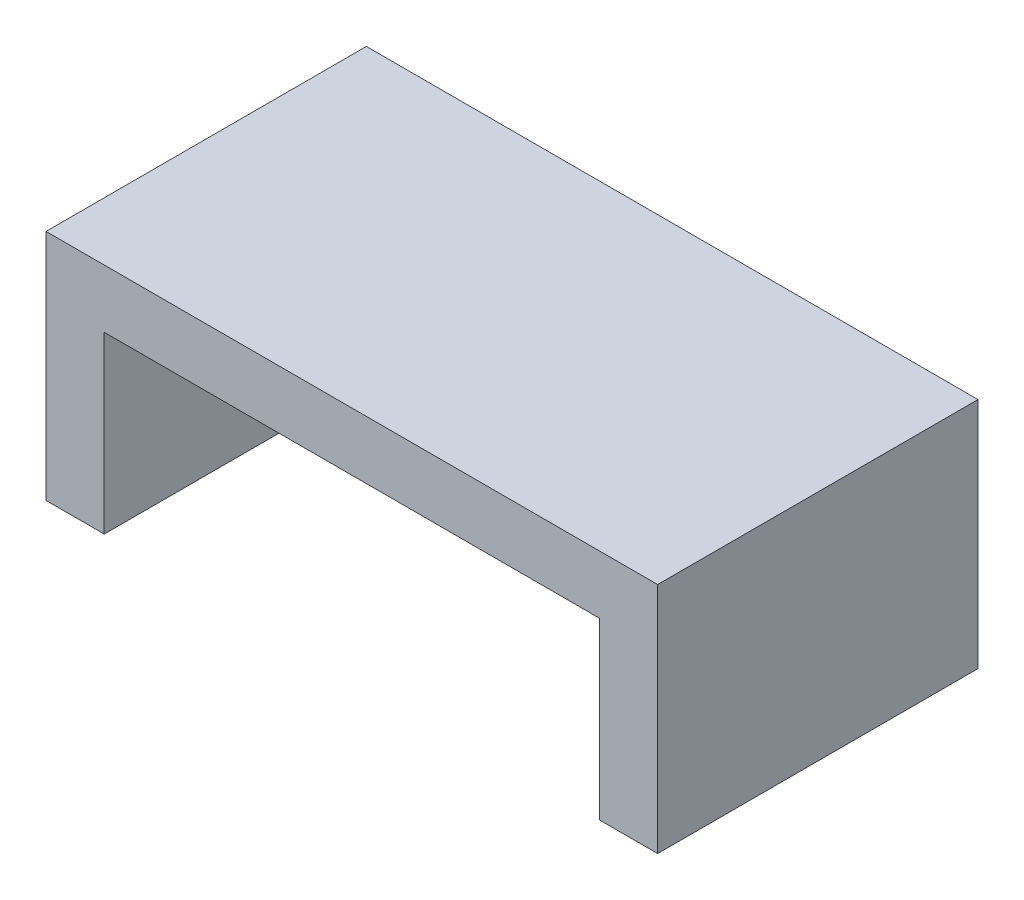
ISO-10303-21;
HEADER;
FILE_DESCRIPTION(('STEP AP214'),'2;1');
FILE_NAME('part.step','',(''),(''),'','','');
FILE_SCHEMA(('AUTOMOTIVE_DESIGN { 1 0 10303 214 1 1 1 1 }'));
ENDSEC;
DATA;
#1=APPLICATION_CONTEXT('core data for automotive mechanical design processes');
#2=APPLICATION_PROTOCOL_DEFINITION('international standard','automotive_design',2000,#1);
#3=PRODUCT_CONTEXT('',#1,'mechanical');
#4=PRODUCT('Part','Part','',(#3));
#5=PRODUCT_RELATED_PRODUCT_CATEGORY('part','',(#4));
#6=PRODUCT_DEFINITION_FORMATION('','',#4);
#7=PRODUCT_DEFINITION_CONTEXT('part definition',#1,'design');
#8=PRODUCT_DEFINITION('design','',#6,#7);
#9=PRODUCT_DEFINITION_SHAPE('','',#8);
#10=(LENGTH_UNIT() NAMED_UNIT(*) SI_UNIT(.MILLI.,.METRE.));
#11=(NAMED_UNIT(*) PLANE_ANGLE_UNIT() SI_UNIT($,.RADIAN.));
#12=(NAMED_UNIT(*) SI_UNIT($,.STERADIAN.) SOLID_ANGLE_UNIT());
#13=UNCERTAINTY_MEASURE_WITH_UNIT(LENGTH_MEASURE(1.E-05),#10,'distance_accuracy_value','');
#14=(GEOMETRIC_REPRESENTATION_CONTEXT(3) GLOBAL_UNCERTAINTY_ASSIGNED_CONTEXT((#13)) GLOBAL_UNIT_ASSIGNED_CONTEXT((#10,
#11,#12)) REPRESENTATION_CONTEXT('',''));
#15=CARTESIAN_POINT('',(0.,0.,0.));
#16=DIRECTION('',(0.,0.,1.));
#17=DIRECTION('',(1.,0.,0.));
#18=AXIS2_PLACEMENT_3D('',#15,#16,#17);
#19=CARTESIAN_POINT('',(0.,0.,0.));
#20=DIRECTION('',(0.,1.,0.));
#21=DIRECTION('',(0.,0.,1.));
#22=AXIS2_PLACEMENT_3D('',#19,#20,#21);
#23=PLANE('',#22);
#24=DIRECTION('',(-1.,0.,0.));
#25=VECTOR('',#24,1.);
#26=CARTESIAN_POINT('',(-18.3662267058814,0.,-12.40239900559));
#27=LINE('',#26,#25);
#28=CARTESIAN_POINT('',(-14.3662267058814,0.,-12.40239900559));
#29=VERTEX_POINT('',#28);
#30=CARTESIAN_POINT('',(-18.3662267058814,0.,-12.40239900559));
#31=VERTEX_POINT('',#30);
#32=EDGE_CURVE('E78',#29,#31,#27,.T.);
#33=ORIENTED_EDGE('',*,*,#32,.F.);
#34=DIRECTION('',(0.,0.,1.));
#35=VECTOR('',#34,1.);
#36=CARTESIAN_POINT('',(-14.3662267058814,0.,-12.40239900559));
#37=LINE('',#36,#35);
#38=CARTESIAN_POINT('',(-14.3662267058814,0.,9.59760099440999));
#39=VERTEX_POINT('',#38);
#40=EDGE_CURVE('E106',#29,#39,#37,.T.);
#41=ORIENTED_EDGE('',*,*,#40,.T.);
#42=DIRECTION('',(1.,0.,0.));
#43=VECTOR('',#42,1.);
#44=CARTESIAN_POINT('',(-18.3662267058814,0.,9.59760099440999));
#45=LINE('',#44,#43);
#46=CARTESIAN_POINT('',(-18.3662267058814,0.,9.59760099440999));
#47=VERTEX_POINT('',#46);
#48=EDGE_CURVE('E130',#47,#39,#45,.T.);
#49=ORIENTED_EDGE('',*,*,#48,.F.);
#50=DIRECTION('',(0.,0.,1.));
#51=VECTOR('',#50,1.);
#52=CARTESIAN_POINT('',(-18.3662267058814,0.,-12.40239900559));
#53=LINE('',#52,#51);
#54=EDGE_CURVE('E124',#31,#47,#53,.T.);
#55=ORIENTED_EDGE('',*,*,#54,.F.);
#56=EDGE_LOOP('',(#33,#41,#49,#55));
#57=FACE_BOUND('',#56,.T.);
#58=ADVANCED_FACE('F33',(#57),#23,.F.);
#59=CARTESIAN_POINT('',(-18.3662267058814,16.,-12.40239900559));
#60=DIRECTION('',(1.,0.,0.));
#61=DIRECTION('',(0.,0.,-1.));
#62=AXIS2_PLACEMENT_3D('',#59,#60,#61);
#63=PLANE('',#62);
#64=ORIENTED_EDGE('',*,*,#54,.T.);
#65=DIRECTION('',(0.,-1.,0.));
#66=VECTOR('',#65,1.);
#67=CARTESIAN_POINT('',(-18.3662267058814,16.,9.59760099440999));
#68=LINE('',#67,#66);
#69=CARTESIAN_POINT('',(-18.3662267058814,16.,9.59760099440999));
#70=VERTEX_POINT('',#69);
#71=EDGE_CURVE('E11',#70,#47,#68,.T.);
#72=ORIENTED_EDGE('',*,*,#71,.F.);
#73=DIRECTION('',(0.,0.,1.));
#74=VECTOR('',#73,1.);
#75=CARTESIAN_POINT('',(-18.3662267058814,16.,-12.40239900559));
#76=LINE('',#75,#74);
#77=CARTESIAN_POINT('',(-18.3662267058814,16.,-12.40239900559));
#78=VERTEX_POINT('',#77);
#79=EDGE_CURVE('E129',#78,#70,#76,.T.);
#80=ORIENTED_EDGE('',*,*,#79,.F.);
#81=DIRECTION('',(0.,-1.,0.));
#82=VECTOR('',#81,1.);
#83=CARTESIAN_POINT('',(-18.3662267058814,16.,-12.40239900559));
#84=LINE('',#83,#82);
#85=EDGE_CURVE('E134',#78,#31,#84,.T.);
#86=ORIENTED_EDGE('',*,*,#85,.T.);
#87=EDGE_LOOP('',(#64,#72,#80,#86));
#88=FACE_BOUND('',#87,.T.);
#89=ADVANCED_FACE('F35',(#88),#63,.F.);
#90=CARTESIAN_POINT('',(-18.3662267058814,16.,9.59760099440999));
#91=DIRECTION('',(0.,0.,-1.));
#92=DIRECTION('',(-1.,0.,0.));
#93=AXIS2_PLACEMENT_3D('',#90,#91,#92);
#94=PLANE('',#93);
#95=DIRECTION('',(1.,0.,0.));
#96=VECTOR('',#95,1.);
#97=CARTESIAN_POINT('',(-18.3662267058814,12.,9.59760099440999));
#98=LINE('',#97,#96);
#99=CARTESIAN_POINT('',(-14.3662267058814,12.,9.59760099440999));
#100=VERTEX_POINT('',#99);
#101=CARTESIAN_POINT('',(19.6337732941186,12.,9.59760099440999));
#102=VERTEX_POINT('',#101);
#103=EDGE_CURVE('E159',#100,#102,#98,.T.);
#104=ORIENTED_EDGE('',*,*,#103,.T.);
#105=DIRECTION('',(0.,-1.,0.));
#106=VECTOR('',#105,1.);
#107=CARTESIAN_POINT('',(19.6337732941186,16.,9.59760099440999));
#108=LINE('',#107,#106);
#109=CARTESIAN_POINT('',(19.6337732941186,0.,9.59760099440999));
#110=VERTEX_POINT('',#109);
#111=EDGE_CURVE('E158',#102,#110,#108,.T.);
#112=ORIENTED_EDGE('',*,*,#111,.T.);
#113=CARTESIAN_POINT('',(23.6337732941186,0.,9.59760099440999));
#114=VERTEX_POINT('',#113);
#115=EDGE_CURVE('E149',#110,#114,#45,.T.);
#116=ORIENTED_EDGE('',*,*,#115,.T.);
#117=DIRECTION('',(0.,-1.,0.));
#118=VECTOR('',#117,1.);
#119=CARTESIAN_POINT('',(23.6337732941186,16.,9.59760099440999));
#120=LINE('',#119,#118);
#121=CARTESIAN_POINT('',(23.6337732941186,16.,9.59760099440999));
#122=VERTEX_POINT('',#121);
#123=EDGE_CURVE('E41',#122,#114,#120,.T.);
#124=ORIENTED_EDGE('',*,*,#123,.F.);
#125=DIRECTION('',(1.,0.,0.));
#126=VECTOR('',#125,1.);
#127=CARTESIAN_POINT('',(-18.3662267058814,16.,9.59760099440999));
#128=LINE('',#127,#126);
#129=EDGE_CURVE('E85',#70,#122,#128,.T.);
#130=ORIENTED_EDGE('',*,*,#129,.F.);
#131=ORIENTED_EDGE('',*,*,#71,.T.);
#132=ORIENTED_EDGE('',*,*,#48,.T.);
#133=DIRECTION('',(0.,-1.,0.));
#134=VECTOR('',#133,1.);
#135=CARTESIAN_POINT('',(-14.3662267058814,16.,9.59760099440999));
#136=LINE('',#135,#134);
#137=EDGE_CURVE('E112',#100,#39,#136,.T.);
#138=ORIENTED_EDGE('',*,*,#137,.F.);
#139=EDGE_LOOP('',(#104,#112,#116,#124,#130,#131,#132,#138));
#140=FACE_BOUND('',#139,.T.);
#141=ADVANCED_FACE('F157',(#140),#94,.F.);
#142=CARTESIAN_POINT('',(23.6337732941186,16.,-12.40239900559));
#143=DIRECTION('',(-1.,0.,0.));
#144=DIRECTION('',(0.,0.,1.));
#145=AXIS2_PLACEMENT_3D('',#142,#143,#144);
#146=PLANE('',#145);
#147=DIRECTION('',(0.,0.,-1.));
#148=VECTOR('',#147,1.);
#149=CARTESIAN_POINT('',(23.6337732941186,0.,-12.40239900559));
#150=LINE('',#149,#148);
#151=CARTESIAN_POINT('',(23.6337732941186,0.,-12.40239900559));
#152=VERTEX_POINT('',#151);
#153=EDGE_CURVE('E126',#114,#152,#150,.T.);
#154=ORIENTED_EDGE('',*,*,#153,.T.);
#155=DIRECTION('',(0.,-1.,0.));
#156=VECTOR('',#155,1.);
#157=CARTESIAN_POINT('',(23.6337732941186,16.,-12.40239900559));
#158=LINE('',#157,#156);
#159=CARTESIAN_POINT('',(23.6337732941186,16.,-12.40239900559));
#160=VERTEX_POINT('',#159);
#161=EDGE_CURVE('E136',#160,#152,#158,.T.);
#162=ORIENTED_EDGE('',*,*,#161,.F.);
#163=DIRECTION('',(0.,0.,-1.));
#164=VECTOR('',#163,1.);
#165=CARTESIAN_POINT('',(23.6337732941186,16.,-12.40239900559));
#166=LINE('',#165,#164);
#167=EDGE_CURVE('E144',#122,#160,#166,.T.);
#168=ORIENTED_EDGE('',*,*,#167,.F.);
#169=ORIENTED_EDGE('',*,*,#123,.T.);
#170=EDGE_LOOP('',(#154,#162,#168,#169));
#171=FACE_BOUND('',#170,.T.);
#172=ADVANCED_FACE('F142',(#171),#146,.F.);
#173=CARTESIAN_POINT('',(-18.3662267058814,16.,-12.40239900559));
#174=DIRECTION('',(0.,0.,1.));
#175=DIRECTION('',(1.,0.,0.));
#176=AXIS2_PLACEMENT_3D('',#173,#174,#175);
#177=PLANE('',#176);
#178=DIRECTION('',(-1.,0.,0.));
#179=VECTOR('',#178,1.);
#180=CARTESIAN_POINT('',(-18.3662267058814,12.,-12.40239900559));
#181=LINE('',#180,#179);
#182=CARTESIAN_POINT('',(19.6337732941186,12.,-12.40239900559));
#183=VERTEX_POINT('',#182);
#184=CARTESIAN_POINT('',(-14.3662267058814,12.,-12.40239900559));
#185=VERTEX_POINT('',#184);
#186=EDGE_CURVE('E120',#183,#185,#181,.T.);
#187=ORIENTED_EDGE('',*,*,#186,.T.);
#188=DIRECTION('',(0.,-1.,0.));
#189=VECTOR('',#188,1.);
#190=CARTESIAN_POINT('',(-14.3662267058814,16.,-12.40239900559));
#191=LINE('',#190,#189);
#192=EDGE_CURVE('E109',#185,#29,#191,.T.);
#193=ORIENTED_EDGE('',*,*,#192,.T.);
#194=ORIENTED_EDGE('',*,*,#32,.T.);
#195=ORIENTED_EDGE('',*,*,#85,.F.);
#196=DIRECTION('',(-1.,0.,0.));
#197=VECTOR('',#196,1.);
#198=CARTESIAN_POINT('',(-18.3662267058814,16.,-12.40239900559));
#199=LINE('',#198,#197);
#200=EDGE_CURVE('E57',#160,#78,#199,.T.);
#201=ORIENTED_EDGE('',*,*,#200,.F.);
#202=ORIENTED_EDGE('',*,*,#161,.T.);
#203=CARTESIAN_POINT('',(19.6337732941186,0.,-12.40239900559));
#204=VERTEX_POINT('',#203);
#205=EDGE_CURVE('E125',#152,#204,#27,.T.);
#206=ORIENTED_EDGE('',*,*,#205,.T.);
#207=DIRECTION('',(0.,-1.,0.));
#208=VECTOR('',#207,1.);
#209=CARTESIAN_POINT('',(19.6337732941186,16.,-12.40239900559));
#210=LINE('',#209,#208);
#211=EDGE_CURVE('E48',#183,#204,#210,.T.);
#212=ORIENTED_EDGE('',*,*,#211,.F.);
#213=EDGE_LOOP('',(#187,#193,#194,#195,#201,#202,#206,#212));
#214=FACE_BOUND('',#213,.T.);
#215=ADVANCED_FACE('F118',(#214),#177,.F.);
#216=CARTESIAN_POINT('',(0.,16.,0.));
#217=DIRECTION('',(0.,1.,0.));
#218=DIRECTION('',(0.,0.,1.));
#219=AXIS2_PLACEMENT_3D('',#216,#217,#218);
#220=PLANE('',#219);
#221=ORIENTED_EDGE('',*,*,#79,.T.);
#222=ORIENTED_EDGE('',*,*,#129,.T.);
#223=ORIENTED_EDGE('',*,*,#167,.T.);
#224=ORIENTED_EDGE('',*,*,#200,.T.);
#225=EDGE_LOOP('',(#221,#222,#223,#224));
#226=FACE_BOUND('',#225,.T.);
#227=ADVANCED_FACE('F169',(#226),#220,.T.);
#228=ORIENTED_EDGE('',*,*,#115,.F.);
#229=DIRECTION('',(0.,0.,-1.));
#230=VECTOR('',#229,1.);
#231=CARTESIAN_POINT('',(19.6337732941186,0.,-12.40239900559));
#232=LINE('',#231,#230);
#233=EDGE_CURVE('E115',#110,#204,#232,.T.);
#234=ORIENTED_EDGE('',*,*,#233,.T.);
#235=ORIENTED_EDGE('',*,*,#205,.F.);
#236=ORIENTED_EDGE('',*,*,#153,.F.);
#237=EDGE_LOOP('',(#228,#234,#235,#236));
#238=FACE_BOUND('',#237,.T.);
#239=ADVANCED_FACE('F148',(#238),#23,.F.);
#240=CARTESIAN_POINT('',(-14.3662267058814,16.,-12.40239900559));
#241=DIRECTION('',(1.,0.,0.));
#242=DIRECTION('',(0.,0.,-1.));
#243=AXIS2_PLACEMENT_3D('',#240,#241,#242);
#244=PLANE('',#243);
#245=ORIENTED_EDGE('',*,*,#40,.F.);
#246=ORIENTED_EDGE('',*,*,#192,.F.);
#247=DIRECTION('',(0.,0.,1.));
#248=VECTOR('',#247,1.);
#249=CARTESIAN_POINT('',(-14.3662267058814,12.,-12.40239900559));
#250=LINE('',#249,#248);
#251=EDGE_CURVE('E167',#185,#100,#250,.T.);
#252=ORIENTED_EDGE('',*,*,#251,.T.);
#253=ORIENTED_EDGE('',*,*,#137,.T.);
#254=EDGE_LOOP('',(#245,#246,#252,#253));
#255=FACE_BOUND('',#254,.T.);
#256=ADVANCED_FACE('F107',(#255),#244,.T.);
#257=CARTESIAN_POINT('',(19.6337732941186,16.,-12.40239900559));
#258=DIRECTION('',(-1.,0.,0.));
#259=DIRECTION('',(0.,0.,1.));
#260=AXIS2_PLACEMENT_3D('',#257,#258,#259);
#261=PLANE('',#260);
#262=ORIENTED_EDGE('',*,*,#233,.F.);
#263=ORIENTED_EDGE('',*,*,#111,.F.);
#264=DIRECTION('',(0.,0.,-1.));
#265=VECTOR('',#264,1.);
#266=CARTESIAN_POINT('',(19.6337732941186,12.,-12.40239900559));
#267=LINE('',#266,#265);
#268=EDGE_CURVE('E166',#102,#183,#267,.T.);
#269=ORIENTED_EDGE('',*,*,#268,.T.);
#270=ORIENTED_EDGE('',*,*,#211,.T.);
#271=EDGE_LOOP('',(#262,#263,#269,#270));
#272=FACE_BOUND('',#271,.T.);
#273=ADVANCED_FACE('F187',(#272),#261,.T.);
#274=CARTESIAN_POINT('',(0.,12.,0.));
#275=DIRECTION('',(0.,1.,0.));
#276=DIRECTION('',(0.,0.,1.));
#277=AXIS2_PLACEMENT_3D('',#274,#275,#276);
#278=PLANE('',#277);
#279=ORIENTED_EDGE('',*,*,#251,.F.);
#280=ORIENTED_EDGE('',*,*,#186,.F.);
#281=ORIENTED_EDGE('',*,*,#268,.F.);
#282=ORIENTED_EDGE('',*,*,#103,.F.);
#283=EDGE_LOOP('',(#279,#280,#281,#282));
#284=FACE_BOUND('',#283,.T.);
#285=ADVANCED_FACE('F193',(#284),#278,.F.);
#286=CLOSED_SHELL('',(#58,#89,#141,#172,#215,#227,#239,#256,#273,#285));
#287=MANIFOLD_SOLID_BREP('B2',#286);
#288=ADVANCED_BREP_SHAPE_REPRESENTATION('',(#18,#287),#14);
#289=SHAPE_DEFINITION_REPRESENTATION(#9,#288);
ENDSEC;
END-ISO-10303-21;
